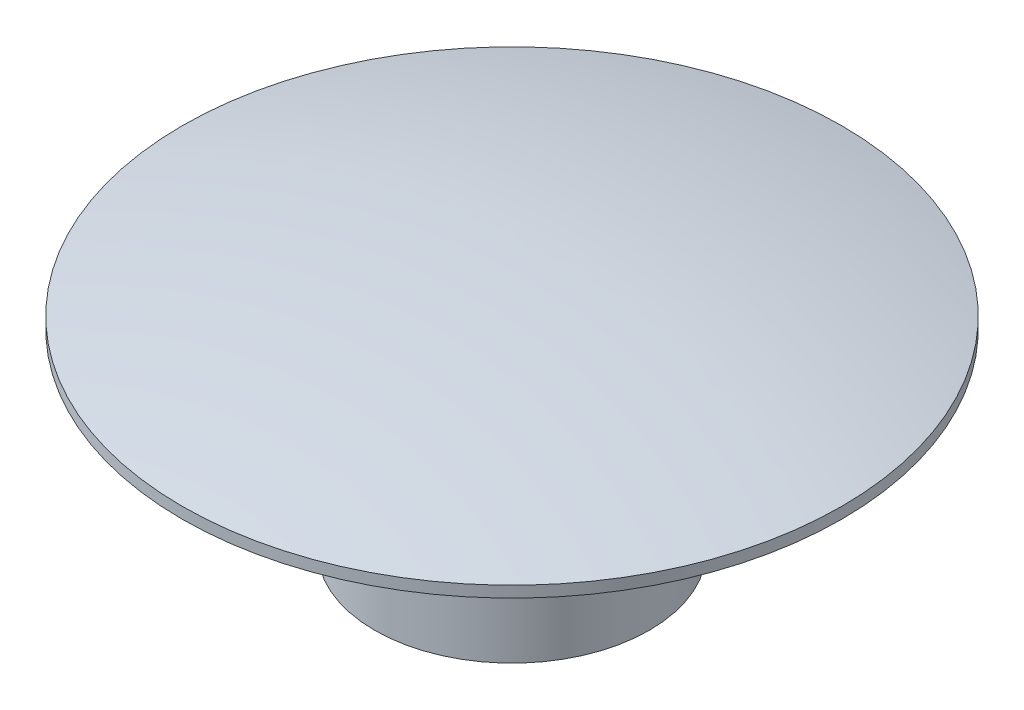
ISO-10303-21;
HEADER;
FILE_DESCRIPTION(('STEP AP214'),'2;1');
FILE_NAME('part.step','',(''),(''),'','','');
FILE_SCHEMA(('AUTOMOTIVE_DESIGN { 1 0 10303 214 1 1 1 1 }'));
ENDSEC;
DATA;
#1=APPLICATION_CONTEXT('core data for automotive mechanical design processes');
#2=APPLICATION_PROTOCOL_DEFINITION('international standard','automotive_design',2000,#1);
#3=PRODUCT_CONTEXT('',#1,'mechanical');
#4=PRODUCT('Part','Part','',(#3));
#5=PRODUCT_RELATED_PRODUCT_CATEGORY('part','',(#4));
#6=PRODUCT_DEFINITION_FORMATION('','',#4);
#7=PRODUCT_DEFINITION_CONTEXT('part definition',#1,'design');
#8=PRODUCT_DEFINITION('design','',#6,#7);
#9=PRODUCT_DEFINITION_SHAPE('','',#8);
#10=(LENGTH_UNIT() NAMED_UNIT(*) SI_UNIT(.MILLI.,.METRE.));
#11=(NAMED_UNIT(*) PLANE_ANGLE_UNIT() SI_UNIT($,.RADIAN.));
#12=(NAMED_UNIT(*) SI_UNIT($,.STERADIAN.) SOLID_ANGLE_UNIT());
#13=UNCERTAINTY_MEASURE_WITH_UNIT(LENGTH_MEASURE(1.E-05),#10,'distance_accuracy_value','');
#14=(GEOMETRIC_REPRESENTATION_CONTEXT(3) GLOBAL_UNCERTAINTY_ASSIGNED_CONTEXT((#13)) GLOBAL_UNIT_ASSIGNED_CONTEXT((#10,
#11,#12)) REPRESENTATION_CONTEXT('',''));
#15=CARTESIAN_POINT('',(0.,0.,0.));
#16=DIRECTION('',(0.,0.,1.));
#17=DIRECTION('',(1.,0.,0.));
#18=AXIS2_PLACEMENT_3D('',#15,#16,#17);
#19=CARTESIAN_POINT('',(0.,-22.,0.));
#20=DIRECTION('',(0.,-1.,0.));
#21=DIRECTION('',(1.,0.,0.));
#22=AXIS2_PLACEMENT_3D('',#19,#20,#21);
#23=SPHERICAL_SURFACE('',#22,23.);
#24=CARTESIAN_POINT('',(0.,0.203603311174517,0.));
#25=DIRECTION('',(0.,-1.,0.));
#26=DIRECTION('',(0.,0.,-1.));
#27=AXIS2_PLACEMENT_3D('',#24,#25,#26);
#28=CIRCLE('',#27,6.);
#29=CARTESIAN_POINT('',(0.,0.203603311174517,-6.));
#30=VERTEX_POINT('',#29);
#31=EDGE_CURVE('E38',#30,#30,#28,.T.);
#32=ORIENTED_EDGE('',*,*,#31,.F.);
#33=EDGE_LOOP('',(#32));
#34=FACE_BOUND('',#33,.T.);
#35=ADVANCED_FACE('F24',(#34),#23,.T.);
#36=CARTESIAN_POINT('',(0.,-3.5,0.));
#37=DIRECTION('',(0.,1.,0.));
#38=DIRECTION('',(0.,0.,1.));
#39=AXIS2_PLACEMENT_3D('',#36,#37,#38);
#40=PLANE('',#39);
#41=CARTESIAN_POINT('',(0.,-3.5,0.));
#42=DIRECTION('',(0.,-1.,0.));
#43=DIRECTION('',(0.,0.,-1.));
#44=AXIS2_PLACEMENT_3D('',#41,#42,#43);
#45=CIRCLE('',#44,2.5);
#46=CARTESIAN_POINT('',(0.,-3.5,-2.5));
#47=VERTEX_POINT('',#46);
#48=EDGE_CURVE('E10',#47,#47,#45,.T.);
#49=ORIENTED_EDGE('',*,*,#48,.T.);
#50=EDGE_LOOP('',(#49));
#51=FACE_BOUND('',#50,.T.);
#52=ADVANCED_FACE('F47',(#51),#40,.F.);
#53=CARTESIAN_POINT('',(0.,-17.3253086419753,0.));
#54=DIRECTION('',(0.,-1.,0.));
#55=DIRECTION('',(0.,0.,-1.));
#56=AXIS2_PLACEMENT_3D('',#53,#54,#55);
#57=CYLINDRICAL_SURFACE('',#56,2.5);
#58=ORIENTED_EDGE('',*,*,#48,.F.);
#59=EDGE_LOOP('',(#58));
#60=FACE_BOUND('',#59,.T.);
#61=CARTESIAN_POINT('',(0.,0.,0.));
#62=DIRECTION('',(0.,-1.,0.));
#63=DIRECTION('',(0.,0.,-1.));
#64=AXIS2_PLACEMENT_3D('',#61,#62,#63);
#65=CIRCLE('',#64,2.5);
#66=CARTESIAN_POINT('',(0.,0.,-2.5));
#67=VERTEX_POINT('',#66);
#68=EDGE_CURVE('E30',#67,#67,#65,.T.);
#69=ORIENTED_EDGE('',*,*,#68,.T.);
#70=EDGE_LOOP('',(#69));
#71=FACE_BOUND('',#70,.T.);
#72=ADVANCED_FACE('F51',(#60,#71),#57,.T.);
#73=CARTESIAN_POINT('',(-2.5,0.,0.));
#74=DIRECTION('',(0.,1.,0.));
#75=DIRECTION('',(0.,0.,1.));
#76=AXIS2_PLACEMENT_3D('',#73,#74,#75);
#77=PLANE('',#76);
#78=ORIENTED_EDGE('',*,*,#68,.F.);
#79=EDGE_LOOP('',(#78));
#80=FACE_BOUND('',#79,.T.);
#81=CARTESIAN_POINT('',(0.,0.,0.));
#82=DIRECTION('',(0.,-1.,0.));
#83=DIRECTION('',(0.,0.,-1.));
#84=AXIS2_PLACEMENT_3D('',#81,#82,#83);
#85=CIRCLE('',#84,6.);
#86=CARTESIAN_POINT('',(0.,0.,-6.));
#87=VERTEX_POINT('',#86);
#88=EDGE_CURVE('E34',#87,#87,#85,.T.);
#89=ORIENTED_EDGE('',*,*,#88,.T.);
#90=EDGE_LOOP('',(#89));
#91=FACE_BOUND('',#90,.T.);
#92=ADVANCED_FACE('F55',(#80,#91),#77,.F.);
#93=CARTESIAN_POINT('',(0.,-17.3253086419753,0.));
#94=DIRECTION('',(0.,-1.,0.));
#95=DIRECTION('',(0.,0.,-1.));
#96=AXIS2_PLACEMENT_3D('',#93,#94,#95);
#97=CYLINDRICAL_SURFACE('',#96,6.);
#98=ORIENTED_EDGE('',*,*,#88,.F.);
#99=EDGE_LOOP('',(#98));
#100=FACE_BOUND('',#99,.T.);
#101=ORIENTED_EDGE('',*,*,#31,.T.);
#102=EDGE_LOOP('',(#101));
#103=FACE_BOUND('',#102,.T.);
#104=ADVANCED_FACE('F44',(#100,#103),#97,.T.);
#105=CLOSED_SHELL('',(#35,#52,#72,#92,#104));
#106=MANIFOLD_SOLID_BREP('B2',#105);
#107=ADVANCED_BREP_SHAPE_REPRESENTATION('',(#18,#106),#14);
#108=SHAPE_DEFINITION_REPRESENTATION(#9,#107);
ENDSEC;
END-ISO-10303-21;
